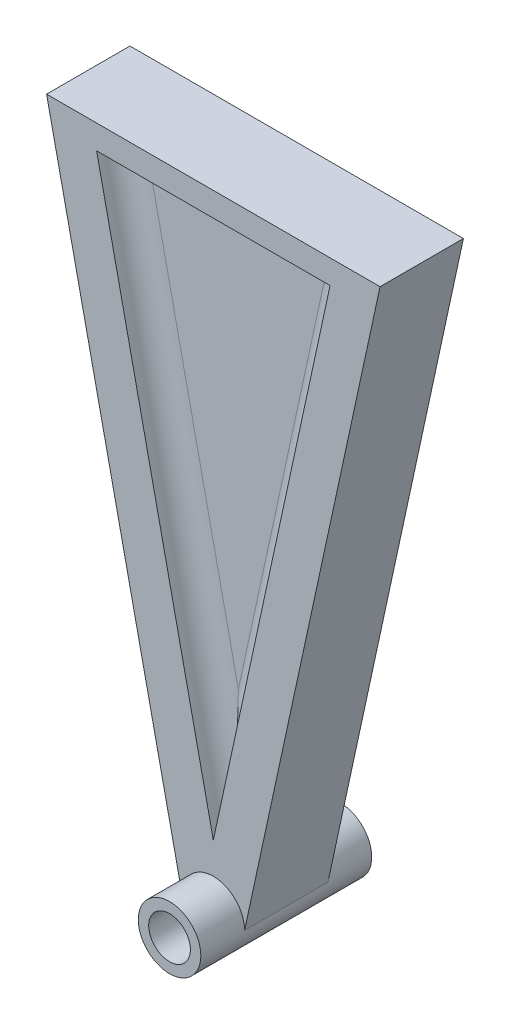
ISO-10303-21;
HEADER;
FILE_DESCRIPTION(('STEP AP214'),'2;1');
FILE_NAME('part.step','',(''),(''),'','','');
FILE_SCHEMA(('AUTOMOTIVE_DESIGN { 1 0 10303 214 1 1 1 1 }'));
ENDSEC;
DATA;
#1=APPLICATION_CONTEXT('core data for automotive mechanical design processes');
#2=APPLICATION_PROTOCOL_DEFINITION('international standard','automotive_design',2000,#1);
#3=PRODUCT_CONTEXT('',#1,'mechanical');
#4=PRODUCT('Part','Part','',(#3));
#5=PRODUCT_RELATED_PRODUCT_CATEGORY('part','',(#4));
#6=PRODUCT_DEFINITION_FORMATION('','',#4);
#7=PRODUCT_DEFINITION_CONTEXT('part definition',#1,'design');
#8=PRODUCT_DEFINITION('design','',#6,#7);
#9=PRODUCT_DEFINITION_SHAPE('','',#8);
#10=(LENGTH_UNIT() NAMED_UNIT(*) SI_UNIT(.MILLI.,.METRE.));
#11=(NAMED_UNIT(*) PLANE_ANGLE_UNIT() SI_UNIT($,.RADIAN.));
#12=(NAMED_UNIT(*) SI_UNIT($,.STERADIAN.) SOLID_ANGLE_UNIT());
#13=UNCERTAINTY_MEASURE_WITH_UNIT(LENGTH_MEASURE(1.E-05),#10,'distance_accuracy_value','');
#14=(GEOMETRIC_REPRESENTATION_CONTEXT(3) GLOBAL_UNCERTAINTY_ASSIGNED_CONTEXT((#13)) GLOBAL_UNIT_ASSIGNED_CONTEXT((#10,
#11,#12)) REPRESENTATION_CONTEXT('',''));
#15=CARTESIAN_POINT('',(0.,0.,0.));
#16=DIRECTION('',(0.,0.,1.));
#17=DIRECTION('',(1.,0.,0.));
#18=AXIS2_PLACEMENT_3D('',#15,#16,#17);
#19=CARTESIAN_POINT('',(-40.,150.,10.5));
#20=DIRECTION('',(0.,0.,1.));
#21=DIRECTION('',(1.,0.,0.));
#22=AXIS2_PLACEMENT_3D('',#19,#20,#21);
#23=PLANE('',#22);
#24=DIRECTION('',(-0.211753347005806,-0.977323140026797,0.));
#25=VECTOR('',#24,1.);
#26=CARTESIAN_POINT('',(7.5,0.,10.5));
#27=LINE('',#26,#25);
#28=CARTESIAN_POINT('',(40.,150.,10.5));
#29=VERTEX_POINT('',#28);
#30=CARTESIAN_POINT('',(7.5,0.,10.5));
#31=VERTEX_POINT('',#30);
#32=EDGE_CURVE('E176',#29,#31,#27,.T.);
#33=ORIENTED_EDGE('',*,*,#32,.T.);
#34=CARTESIAN_POINT('',(0.,0.,10.5));
#35=DIRECTION('',(0.,0.,1.));
#36=DIRECTION('',(1.,0.,0.));
#37=AXIS2_PLACEMENT_3D('',#34,#35,#36);
#38=CIRCLE('',#37,7.5);
#39=CARTESIAN_POINT('',(-7.5,0.,10.5));
#40=VERTEX_POINT('',#39);
#41=EDGE_CURVE('E202',#31,#40,#38,.T.);
#42=ORIENTED_EDGE('',*,*,#41,.T.);
#43=DIRECTION('',(0.211753347005806,-0.977323140026797,0.));
#44=VECTOR('',#43,1.);
#45=CARTESIAN_POINT('',(-7.5,0.,10.5));
#46=LINE('',#45,#44);
#47=CARTESIAN_POINT('',(-40.,150.,10.5));
#48=VERTEX_POINT('',#47);
#49=EDGE_CURVE('E181',#48,#40,#46,.T.);
#50=ORIENTED_EDGE('',*,*,#49,.F.);
#51=DIRECTION('',(-1.,0.,0.));
#52=VECTOR('',#51,1.);
#53=CARTESIAN_POINT('',(-40.,150.,10.5));
#54=LINE('',#53,#52);
#55=EDGE_CURVE('E195',#29,#48,#54,.T.);
#56=ORIENTED_EDGE('',*,*,#55,.F.);
#57=EDGE_LOOP('',(#33,#42,#50,#56));
#58=FACE_BOUND('',#57,.T.);
#59=DIRECTION('',(1.,0.,0.));
#60=VECTOR('',#59,1.);
#61=CARTESIAN_POINT('',(-40.,144.230769230769,10.5));
#62=LINE('',#61,#60);
#63=CARTESIAN_POINT('',(-28.,144.230769230769,10.5));
#64=VERTEX_POINT('',#63);
#65=CARTESIAN_POINT('',(28.,144.230769230769,10.5));
#66=VERTEX_POINT('',#65);
#67=EDGE_CURVE('E119',#64,#66,#62,.T.);
#68=ORIENTED_EDGE('',*,*,#67,.F.);
#69=DIRECTION('',(-0.211753347005806,0.977323140026797,0.));
#70=VECTOR('',#69,1.);
#71=CARTESIAN_POINT('',(-29.7320244096577,152.224728044574,10.5));
#72=LINE('',#71,#70);
#73=CARTESIAN_POINT('',(0.,15.,10.5));
#74=VERTEX_POINT('',#73);
#75=EDGE_CURVE('E114',#74,#64,#72,.T.);
#76=ORIENTED_EDGE('',*,*,#75,.F.);
#77=DIRECTION('',(-0.211753347005806,-0.977323140026797,0.));
#78=VECTOR('',#77,1.);
#79=CARTESIAN_POINT('',(26.1448660122048,135.668612364022,10.5));
#80=LINE('',#79,#78);
#81=EDGE_CURVE('E117',#66,#74,#80,.T.);
#82=ORIENTED_EDGE('',*,*,#81,.F.);
#83=EDGE_LOOP('',(#68,#76,#82));
#84=FACE_BOUND('',#83,.T.);
#85=ADVANCED_FACE('F30',(#58,#84),#23,.F.);
#86=CARTESIAN_POINT('',(-40.,150.,30.5));
#87=DIRECTION('',(0.,0.,-1.));
#88=DIRECTION('',(-1.,0.,0.));
#89=AXIS2_PLACEMENT_3D('',#86,#87,#88);
#90=PLANE('',#89);
#91=DIRECTION('',(0.211753347005806,-0.977323140026797,0.));
#92=VECTOR('',#91,1.);
#93=CARTESIAN_POINT('',(-28.,144.230769230769,30.5));
#94=LINE('',#93,#92);
#95=CARTESIAN_POINT('',(-28.,144.230769230769,30.5));
#96=VERTEX_POINT('',#95);
#97=CARTESIAN_POINT('',(0.,15.,30.5));
#98=VERTEX_POINT('',#97);
#99=EDGE_CURVE('E167',#96,#98,#94,.T.);
#100=ORIENTED_EDGE('',*,*,#99,.F.);
#101=DIRECTION('',(-1.,0.,0.));
#102=VECTOR('',#101,1.);
#103=CARTESIAN_POINT('',(-28.,144.230769230769,30.5));
#104=LINE('',#103,#102);
#105=CARTESIAN_POINT('',(28.,144.230769230769,30.5));
#106=VERTEX_POINT('',#105);
#107=EDGE_CURVE('E162',#106,#96,#104,.T.);
#108=ORIENTED_EDGE('',*,*,#107,.F.);
#109=DIRECTION('',(0.211753347005806,0.977323140026797,0.));
#110=VECTOR('',#109,1.);
#111=CARTESIAN_POINT('',(0.,15.,30.5));
#112=LINE('',#111,#110);
#113=EDGE_CURVE('E171',#98,#106,#112,.T.);
#114=ORIENTED_EDGE('',*,*,#113,.F.);
#115=EDGE_LOOP('',(#100,#108,#114));
#116=FACE_BOUND('',#115,.T.);
#117=DIRECTION('',(-0.211753347005806,-0.977323140026797,0.));
#118=VECTOR('',#117,1.);
#119=CARTESIAN_POINT('',(36.4128416025471,133.443884319448,30.5));
#120=LINE('',#119,#118);
#121=CARTESIAN_POINT('',(40.,150.,30.5));
#122=VERTEX_POINT('',#121);
#123=CARTESIAN_POINT('',(7.5,0.,30.5));
#124=VERTEX_POINT('',#123);
#125=EDGE_CURVE('E179',#122,#124,#120,.T.);
#126=ORIENTED_EDGE('',*,*,#125,.F.);
#127=DIRECTION('',(1.,0.,0.));
#128=VECTOR('',#127,1.);
#129=CARTESIAN_POINT('',(-40.,150.,30.5));
#130=LINE('',#129,#128);
#131=CARTESIAN_POINT('',(-40.,150.,30.5));
#132=VERTEX_POINT('',#131);
#133=EDGE_CURVE('E189',#132,#122,#130,.T.);
#134=ORIENTED_EDGE('',*,*,#133,.F.);
#135=DIRECTION('',(0.211753347005806,-0.977323140026797,0.));
#136=VECTOR('',#135,1.);
#137=CARTESIAN_POINT('',(-40.,150.,30.5));
#138=LINE('',#137,#136);
#139=CARTESIAN_POINT('',(-7.5,0.,30.5));
#140=VERTEX_POINT('',#139);
#141=EDGE_CURVE('E183',#132,#140,#138,.T.);
#142=ORIENTED_EDGE('',*,*,#141,.T.);
#143=CARTESIAN_POINT('',(0.,0.,30.5));
#144=DIRECTION('',(0.,0.,-1.));
#145=DIRECTION('',(-1.,0.,0.));
#146=AXIS2_PLACEMENT_3D('',#143,#144,#145);
#147=CIRCLE('',#146,7.5);
#148=EDGE_CURVE('E205',#140,#124,#147,.T.);
#149=ORIENTED_EDGE('',*,*,#148,.T.);
#150=EDGE_LOOP('',(#126,#134,#142,#149));
#151=FACE_BOUND('',#150,.T.);
#152=ADVANCED_FACE('F235',(#116,#151),#90,.F.);
#153=CARTESIAN_POINT('',(0.,0.,41.));
#154=DIRECTION('',(0.,0.,-1.));
#155=DIRECTION('',(-1.,0.,0.));
#156=AXIS2_PLACEMENT_3D('',#153,#154,#155);
#157=CYLINDRICAL_SURFACE('',#156,7.5);
#158=CARTESIAN_POINT('',(0.,0.,41.));
#159=DIRECTION('',(0.,0.,1.));
#160=DIRECTION('',(1.,0.,0.));
#161=AXIS2_PLACEMENT_3D('',#158,#159,#160);
#162=CIRCLE('',#161,7.5);
#163=CARTESIAN_POINT('',(7.5,0.,41.));
#164=VERTEX_POINT('',#163);
#165=EDGE_CURVE('E132',#164,#164,#162,.T.);
#166=ORIENTED_EDGE('',*,*,#165,.F.);
#167=EDGE_LOOP('',(#166));
#168=FACE_BOUND('',#167,.T.);
#169=CARTESIAN_POINT('',(0.,0.,0.));
#170=DIRECTION('',(0.,0.,1.));
#171=DIRECTION('',(1.,0.,0.));
#172=AXIS2_PLACEMENT_3D('',#169,#170,#171);
#173=CIRCLE('',#172,7.5);
#174=CARTESIAN_POINT('',(7.5,0.,0.));
#175=VERTEX_POINT('',#174);
#176=EDGE_CURVE('E135',#175,#175,#173,.T.);
#177=ORIENTED_EDGE('',*,*,#176,.T.);
#178=EDGE_LOOP('',(#177));
#179=FACE_BOUND('',#178,.T.);
#180=DIRECTION('',(0.,0.,-1.));
#181=VECTOR('',#180,1.);
#182=CARTESIAN_POINT('',(7.5,0.,41.));
#183=LINE('',#182,#181);
#184=EDGE_CURVE('E200',#124,#31,#183,.T.);
#185=ORIENTED_EDGE('',*,*,#184,.F.);
#186=ORIENTED_EDGE('',*,*,#148,.F.);
#187=DIRECTION('',(0.,0.,-1.));
#188=VECTOR('',#187,1.);
#189=CARTESIAN_POINT('',(-7.5,0.,41.));
#190=LINE('',#189,#188);
#191=EDGE_CURVE('E198',#40,#140,#190,.F.);
#192=ORIENTED_EDGE('',*,*,#191,.F.);
#193=ORIENTED_EDGE('',*,*,#41,.F.);
#194=EDGE_LOOP('',(#185,#186,#192,#193));
#195=FACE_BOUND('',#194,.T.);
#196=ADVANCED_FACE('F221',(#168,#179,#195),#157,.T.);
#197=CARTESIAN_POINT('',(0.,0.,41.));
#198=DIRECTION('',(0.,0.,-1.));
#199=DIRECTION('',(-1.,0.,0.));
#200=AXIS2_PLACEMENT_3D('',#197,#198,#199);
#201=CYLINDRICAL_SURFACE('',#200,5.);
#202=CARTESIAN_POINT('',(0.,0.,0.));
#203=DIRECTION('',(0.,0.,1.));
#204=DIRECTION('',(1.,0.,0.));
#205=AXIS2_PLACEMENT_3D('',#202,#203,#204);
#206=CIRCLE('',#205,5.);
#207=CARTESIAN_POINT('',(5.,0.,0.));
#208=VERTEX_POINT('',#207);
#209=EDGE_CURVE('E208',#208,#208,#206,.T.);
#210=ORIENTED_EDGE('',*,*,#209,.F.);
#211=EDGE_LOOP('',(#210));
#212=FACE_BOUND('',#211,.T.);
#213=CARTESIAN_POINT('',(0.,0.,41.));
#214=DIRECTION('',(0.,0.,1.));
#215=DIRECTION('',(1.,0.,0.));
#216=AXIS2_PLACEMENT_3D('',#213,#214,#215);
#217=CIRCLE('',#216,5.);
#218=CARTESIAN_POINT('',(5.,0.,41.));
#219=VERTEX_POINT('',#218);
#220=EDGE_CURVE('E209',#219,#219,#217,.T.);
#221=ORIENTED_EDGE('',*,*,#220,.T.);
#222=EDGE_LOOP('',(#221));
#223=FACE_BOUND('',#222,.T.);
#224=ADVANCED_FACE('F217',(#212,#223),#201,.F.);
#225=CARTESIAN_POINT('',(0.,0.,41.));
#226=DIRECTION('',(0.,0.,1.));
#227=DIRECTION('',(1.,0.,0.));
#228=AXIS2_PLACEMENT_3D('',#225,#226,#227);
#229=PLANE('',#228);
#230=ORIENTED_EDGE('',*,*,#165,.T.);
#231=EDGE_LOOP('',(#230));
#232=FACE_BOUND('',#231,.T.);
#233=ORIENTED_EDGE('',*,*,#220,.F.);
#234=EDGE_LOOP('',(#233));
#235=FACE_BOUND('',#234,.T.);
#236=ADVANCED_FACE('F220',(#232,#235),#229,.T.);
#237=CARTESIAN_POINT('',(0.,0.,0.));
#238=DIRECTION('',(0.,0.,1.));
#239=DIRECTION('',(1.,0.,0.));
#240=AXIS2_PLACEMENT_3D('',#237,#238,#239);
#241=PLANE('',#240);
#242=ORIENTED_EDGE('',*,*,#176,.F.);
#243=EDGE_LOOP('',(#242));
#244=FACE_BOUND('',#243,.T.);
#245=ORIENTED_EDGE('',*,*,#209,.T.);
#246=EDGE_LOOP('',(#245));
#247=FACE_BOUND('',#246,.T.);
#248=ADVANCED_FACE('F215',(#244,#247),#241,.F.);
#249=CARTESIAN_POINT('',(-40.,150.,30.5));
#250=DIRECTION('',(0.,1.,0.));
#251=DIRECTION('',(0.,0.,1.));
#252=AXIS2_PLACEMENT_3D('',#249,#250,#251);
#253=PLANE('',#252);
#254=DIRECTION('',(0.,0.,1.));
#255=VECTOR('',#254,1.);
#256=CARTESIAN_POINT('',(-40.,150.,10.5));
#257=LINE('',#256,#255);
#258=EDGE_CURVE('E186',#48,#132,#257,.T.);
#259=ORIENTED_EDGE('',*,*,#258,.T.);
#260=ORIENTED_EDGE('',*,*,#133,.T.);
#261=DIRECTION('',(0.,0.,-1.));
#262=VECTOR('',#261,1.);
#263=CARTESIAN_POINT('',(40.,150.,10.5));
#264=LINE('',#263,#262);
#265=EDGE_CURVE('E192',#122,#29,#264,.T.);
#266=ORIENTED_EDGE('',*,*,#265,.T.);
#267=ORIENTED_EDGE('',*,*,#55,.T.);
#268=EDGE_LOOP('',(#259,#260,#266,#267));
#269=FACE_BOUND('',#268,.T.);
#270=ADVANCED_FACE('F231',(#269),#253,.T.);
#271=CARTESIAN_POINT('',(-7.5,0.,160.5));
#272=DIRECTION('',(0.977323140026797,0.211753347005806,0.));
#273=DIRECTION('',(-0.211753347005806,0.977323140026797,0.));
#274=AXIS2_PLACEMENT_3D('',#271,#272,#273);
#275=PLANE('',#274);
#276=ORIENTED_EDGE('',*,*,#258,.F.);
#277=ORIENTED_EDGE('',*,*,#49,.T.);
#278=ORIENTED_EDGE('',*,*,#191,.T.);
#279=ORIENTED_EDGE('',*,*,#141,.F.);
#280=EDGE_LOOP('',(#276,#277,#278,#279));
#281=FACE_BOUND('',#280,.T.);
#282=ADVANCED_FACE('F246',(#281),#275,.F.);
#283=CARTESIAN_POINT('',(7.5,0.,160.5));
#284=DIRECTION('',(0.977323140026797,-0.211753347005806,0.));
#285=DIRECTION('',(0.211753347005806,0.977323140026797,0.));
#286=AXIS2_PLACEMENT_3D('',#283,#284,#285);
#287=PLANE('',#286);
#288=ORIENTED_EDGE('',*,*,#125,.T.);
#289=ORIENTED_EDGE('',*,*,#184,.T.);
#290=ORIENTED_EDGE('',*,*,#32,.F.);
#291=ORIENTED_EDGE('',*,*,#265,.F.);
#292=EDGE_LOOP('',(#288,#289,#290,#291));
#293=FACE_BOUND('',#292,.T.);
#294=ADVANCED_FACE('F250',(#293),#287,.T.);
#295=CARTESIAN_POINT('',(28.,144.230769230769,24.5));
#296=DIRECTION('',(0.,0.,1.));
#297=DIRECTION('',(1.,0.,0.));
#298=AXIS2_PLACEMENT_3D('',#295,#296,#297);
#299=PLANE('',#298);
#300=DIRECTION('',(0.211753347005806,-0.977323140026797,0.));
#301=VECTOR('',#300,1.);
#302=CARTESIAN_POINT('',(-19.6250502816222,133.912008336418,24.5));
#303=LINE('',#302,#301);
#304=CARTESIAN_POINT('',(-20.5607818087317,138.230769230769,24.5));
#305=VERTEX_POINT('',#304);
#306=CARTESIAN_POINT('',(0.,43.3348531904692,24.5));
#307=VERTEX_POINT('',#306);
#308=EDGE_CURVE('E142',#305,#307,#303,.T.);
#309=ORIENTED_EDGE('',*,*,#308,.T.);
#310=DIRECTION('',(0.211753347005806,0.977323140026797,0.));
#311=VECTOR('',#310,1.);
#312=CARTESIAN_POINT('',(22.1360611598392,145.501289312804,24.5));
#313=LINE('',#312,#311);
#314=CARTESIAN_POINT('',(20.5607818087317,138.230769230769,24.5));
#315=VERTEX_POINT('',#314);
#316=EDGE_CURVE('E144',#307,#315,#313,.T.);
#317=ORIENTED_EDGE('',*,*,#316,.T.);
#318=DIRECTION('',(-1.,0.,0.));
#319=VECTOR('',#318,1.);
#320=CARTESIAN_POINT('',(28.,138.230769230769,24.5));
#321=LINE('',#320,#319);
#322=EDGE_CURVE('E140',#315,#305,#321,.T.);
#323=ORIENTED_EDGE('',*,*,#322,.T.);
#324=EDGE_LOOP('',(#309,#317,#323));
#325=FACE_BOUND('',#324,.T.);
#326=ADVANCED_FACE('F254',(#325),#299,.T.);
#327=CARTESIAN_POINT('',(28.,144.230769230769,15.5));
#328=DIRECTION('',(0.,0.,-1.));
#329=DIRECTION('',(1.,0.,0.));
#330=AXIS2_PLACEMENT_3D('',#327,#328,#329);
#331=PLANE('',#330);
#332=DIRECTION('',(1.,0.,0.));
#333=VECTOR('',#332,1.);
#334=CARTESIAN_POINT('',(28.,138.31468944767,15.5));
#335=LINE('',#334,#333);
#336=CARTESIAN_POINT('',(-20.6648319427618,138.31468944767,15.5));
#337=VERTEX_POINT('',#336);
#338=CARTESIAN_POINT('',(20.6648319427618,138.31468944767,15.5));
#339=VERTEX_POINT('',#338);
#340=EDGE_CURVE('E147',#337,#339,#335,.T.);
#341=ORIENTED_EDGE('',*,*,#340,.T.);
#342=DIRECTION('',(-0.211753347005806,-0.977323140026797,0.));
#343=VECTOR('',#342,1.);
#344=CARTESIAN_POINT('',(-5.78192167026797,16.2527496952247,15.5));
#345=LINE('',#344,#343);
#346=CARTESIAN_POINT('',(20.6466492291,138.230769230769,15.5));
#347=VERTEX_POINT('',#346);
#348=EDGE_CURVE('E11',#339,#347,#345,.T.);
#349=ORIENTED_EDGE('',*,*,#348,.T.);
#350=DIRECTION('',(-0.211753347005806,-0.977323140026797,0.));
#351=VECTOR('',#350,1.);
#352=CARTESIAN_POINT('',(-5.78192167026797,16.2527496952247,15.5));
#353=LINE('',#352,#351);
#354=CARTESIAN_POINT('',(0.042933710184176,43.1366976050038,15.5));
#355=VERTEX_POINT('',#354);
#356=EDGE_CURVE('E39',#347,#355,#353,.T.);
#357=ORIENTED_EDGE('',*,*,#356,.T.);
#358=DIRECTION('',(-0.211753347005806,-0.977323140026797,0.));
#359=VECTOR('',#358,1.);
#360=CARTESIAN_POINT('',(-5.78192167026797,16.2527496952247,15.5));
#361=LINE('',#360,#359);
#362=CARTESIAN_POINT('',(0.,42.9385420195384,15.5));
#363=VERTEX_POINT('',#362);
#364=EDGE_CURVE('E152',#355,#363,#361,.T.);
#365=ORIENTED_EDGE('',*,*,#364,.T.);
#366=DIRECTION('',(-0.211753347005806,0.977323140026797,0.));
#367=VECTOR('',#366,1.);
#368=CARTESIAN_POINT('',(-22.218078329732,145.483518925994,15.5));
#369=LINE('',#368,#367);
#370=CARTESIAN_POINT('',(-20.6466492291,138.230769230769,15.5));
#371=VERTEX_POINT('',#370);
#372=EDGE_CURVE('E128',#363,#371,#369,.T.);
#373=ORIENTED_EDGE('',*,*,#372,.T.);
#374=DIRECTION('',(-0.211753347005806,0.977323140026797,0.));
#375=VECTOR('',#374,1.);
#376=CARTESIAN_POINT('',(-22.218078329732,145.483518925994,15.5));
#377=LINE('',#376,#375);
#378=EDGE_CURVE('E149',#371,#337,#377,.T.);
#379=ORIENTED_EDGE('',*,*,#378,.T.);
#380=EDGE_LOOP('',(#341,#349,#357,#365,#373,#379));
#381=FACE_BOUND('',#380,.T.);
#382=ADVANCED_FACE('F258',(#381),#331,.T.);
#383=CARTESIAN_POINT('',(-19.6250502816222,133.912008336418,30.5));
#384=DIRECTION('',(0.211753347005806,-0.977323140026797,0.));
#385=DIRECTION('',(0.977323140026797,0.211753347005806,0.));
#386=AXIS2_PLACEMENT_3D('',#383,#384,#385);
#387=CYLINDRICAL_SURFACE('',#386,6.);
#388=CARTESIAN_POINT('',(0.,43.3348531904692,30.5));
#389=DIRECTION('',(1.,0.,0.));
#390=DIRECTION('',(0.,1.,0.));
#391=AXIS2_PLACEMENT_3D('',#388,#389,#390);
#392=ELLIPSE('',#391,28.3348531904693,6.);
#393=EDGE_CURVE('E157',#307,#98,#392,.F.);
#394=ORIENTED_EDGE('',*,*,#393,.F.);
#395=ORIENTED_EDGE('',*,*,#308,.F.);
#396=CARTESIAN_POINT('',(-20.5607818087317,138.230769230769,30.5));
#397=DIRECTION('',(-0.627792423096279,-0.778380802373044,0.));
#398=DIRECTION('',(0.778380802373044,-0.627792423096279,0.));
#399=AXIS2_PLACEMENT_3D('',#396,#397,#398);
#400=ELLIPSE('',#399,9.55729916332526,6.);
#401=EDGE_CURVE('E159',#96,#305,#400,.T.);
#402=ORIENTED_EDGE('',*,*,#401,.F.);
#403=ORIENTED_EDGE('',*,*,#99,.T.);
#404=EDGE_LOOP('',(#394,#395,#402,#403));
#405=FACE_BOUND('',#404,.T.);
#406=ADVANCED_FACE('F261',(#405),#387,.F.);
#407=CARTESIAN_POINT('',(28.,138.230769230769,30.5));
#408=DIRECTION('',(-1.,0.,0.));
#409=DIRECTION('',(0.,0.,1.));
#410=AXIS2_PLACEMENT_3D('',#407,#408,#409);
#411=CYLINDRICAL_SURFACE('',#410,6.);
#412=ORIENTED_EDGE('',*,*,#401,.T.);
#413=ORIENTED_EDGE('',*,*,#322,.F.);
#414=CARTESIAN_POINT('',(20.5607818087317,138.230769230769,30.5));
#415=DIRECTION('',(-0.627792423096279,0.778380802373044,0.));
#416=DIRECTION('',(0.778380802373044,0.627792423096279,0.));
#417=AXIS2_PLACEMENT_3D('',#414,#415,#416);
#418=ELLIPSE('',#417,9.55729916332526,6.);
#419=EDGE_CURVE('E155',#106,#315,#418,.T.);
#420=ORIENTED_EDGE('',*,*,#419,.F.);
#421=ORIENTED_EDGE('',*,*,#107,.T.);
#422=EDGE_LOOP('',(#412,#413,#420,#421));
#423=FACE_BOUND('',#422,.T.);
#424=ADVANCED_FACE('F265',(#423),#411,.F.);
#425=CARTESIAN_POINT('',(22.1360611598392,145.501289312804,30.5));
#426=DIRECTION('',(0.211753347005806,0.977323140026797,0.));
#427=DIRECTION('',(-0.977323140026797,0.211753347005806,0.));
#428=AXIS2_PLACEMENT_3D('',#425,#426,#427);
#429=CYLINDRICAL_SURFACE('',#428,6.);
#430=ORIENTED_EDGE('',*,*,#393,.T.);
#431=ORIENTED_EDGE('',*,*,#113,.T.);
#432=ORIENTED_EDGE('',*,*,#419,.T.);
#433=ORIENTED_EDGE('',*,*,#316,.F.);
#434=EDGE_LOOP('',(#430,#431,#432,#433));
#435=FACE_BOUND('',#434,.T.);
#436=ADVANCED_FACE('F277',(#435),#429,.F.);
#437=CARTESIAN_POINT('',(-22.218078329732,145.483518925994,9.5));
#438=DIRECTION('',(0.211753347005806,-0.977323140026797,0.));
#439=DIRECTION('',(0.977323140026797,0.211753347005806,0.));
#440=AXIS2_PLACEMENT_3D('',#437,#438,#439);
#441=CYLINDRICAL_SURFACE('',#440,6.);
#442=CARTESIAN_POINT('',(0.,42.9385420195383,9.5));
#443=DIRECTION('',(1.,0.,0.));
#444=DIRECTION('',(0.,1.,0.));
#445=AXIS2_PLACEMENT_3D('',#442,#443,#444);
#446=ELLIPSE('',#445,28.3348531904693,6.);
#447=EDGE_CURVE('E126',#74,#363,#446,.F.);
#448=ORIENTED_EDGE('',*,*,#447,.F.);
#449=ORIENTED_EDGE('',*,*,#75,.T.);
#450=CARTESIAN_POINT('',(-20.6648319427618,138.31468944767,9.5));
#451=DIRECTION('',(-0.627792423096279,-0.778380802373044,0.));
#452=DIRECTION('',(0.778380802373044,-0.627792423096279,0.));
#453=AXIS2_PLACEMENT_3D('',#450,#451,#452);
#454=ELLIPSE('',#453,9.55729916332526,6.);
#455=EDGE_CURVE('E34',#337,#64,#454,.T.);
#456=ORIENTED_EDGE('',*,*,#455,.F.);
#457=ORIENTED_EDGE('',*,*,#378,.F.);
#458=ORIENTED_EDGE('',*,*,#372,.F.);
#459=EDGE_LOOP('',(#448,#449,#456,#457,#458));
#460=FACE_BOUND('',#459,.T.);
#461=ADVANCED_FACE('F32',(#460),#441,.F.);
#462=CARTESIAN_POINT('',(-28.,138.31468944767,9.5));
#463=DIRECTION('',(-1.,0.,0.));
#464=DIRECTION('',(0.,0.,1.));
#465=AXIS2_PLACEMENT_3D('',#462,#463,#464);
#466=CYLINDRICAL_SURFACE('',#465,6.);
#467=ORIENTED_EDGE('',*,*,#455,.T.);
#468=ORIENTED_EDGE('',*,*,#67,.T.);
#469=CARTESIAN_POINT('',(20.6648319427618,138.31468944767,9.5));
#470=DIRECTION('',(-0.627792423096279,0.778380802373044,0.));
#471=DIRECTION('',(0.778380802373044,0.627792423096279,0.));
#472=AXIS2_PLACEMENT_3D('',#469,#470,#471);
#473=ELLIPSE('',#472,9.55729916332526,6.);
#474=EDGE_CURVE('E129',#339,#66,#473,.T.);
#475=ORIENTED_EDGE('',*,*,#474,.F.);
#476=ORIENTED_EDGE('',*,*,#340,.F.);
#477=EDGE_LOOP('',(#467,#468,#475,#476));
#478=FACE_BOUND('',#477,.T.);
#479=ADVANCED_FACE('F270',(#478),#466,.F.);
#480=CARTESIAN_POINT('',(-5.78192167026797,16.2527496952247,9.5));
#481=DIRECTION('',(0.211753347005806,0.977323140026797,0.));
#482=DIRECTION('',(-0.977323140026797,0.211753347005806,0.));
#483=AXIS2_PLACEMENT_3D('',#480,#481,#482);
#484=CYLINDRICAL_SURFACE('',#483,6.);
#485=ORIENTED_EDGE('',*,*,#356,.F.);
#486=ORIENTED_EDGE('',*,*,#348,.F.);
#487=ORIENTED_EDGE('',*,*,#474,.T.);
#488=ORIENTED_EDGE('',*,*,#81,.T.);
#489=ORIENTED_EDGE('',*,*,#447,.T.);
#490=ORIENTED_EDGE('',*,*,#364,.F.);
#491=EDGE_LOOP('',(#485,#486,#487,#488,#489,#490));
#492=FACE_BOUND('',#491,.T.);
#493=ADVANCED_FACE('F130',(#492),#484,.F.);
#494=CLOSED_SHELL('',(#85,#152,#196,#224,#236,#248,#270,#282,#294,#326,#382,#406,#424,#436,#461,
#479,#493));
#495=MANIFOLD_SOLID_BREP('B2',#494);
#496=ADVANCED_BREP_SHAPE_REPRESENTATION('',(#18,#495),#14);
#497=SHAPE_DEFINITION_REPRESENTATION(#9,#496);
ENDSEC;
END-ISO-10303-21;
